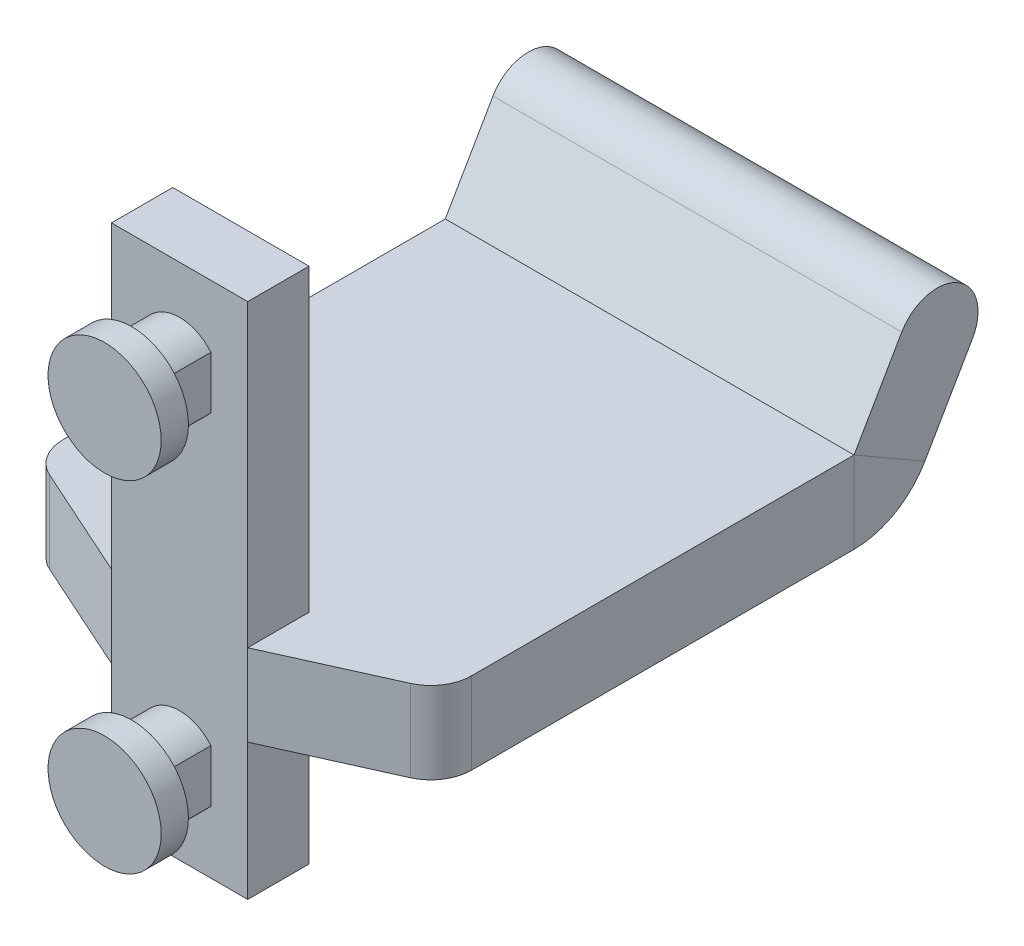
ISO-10303-21;
HEADER;
FILE_DESCRIPTION(('STEP AP214'),'2;1');
FILE_NAME('part.step','',(''),(''),'','','');
FILE_SCHEMA(('AUTOMOTIVE_DESIGN { 1 0 10303 214 1 1 1 1 }'));
ENDSEC;
DATA;
#1=APPLICATION_CONTEXT('core data for automotive mechanical design processes');
#2=APPLICATION_PROTOCOL_DEFINITION('international standard','automotive_design',2000,#1);
#3=PRODUCT_CONTEXT('',#1,'mechanical');
#4=PRODUCT('Part','Part','',(#3));
#5=PRODUCT_RELATED_PRODUCT_CATEGORY('part','',(#4));
#6=PRODUCT_DEFINITION_FORMATION('','',#4);
#7=PRODUCT_DEFINITION_CONTEXT('part definition',#1,'design');
#8=PRODUCT_DEFINITION('design','',#6,#7);
#9=PRODUCT_DEFINITION_SHAPE('','',#8);
#10=(LENGTH_UNIT() NAMED_UNIT(*) SI_UNIT(.MILLI.,.METRE.));
#11=(NAMED_UNIT(*) PLANE_ANGLE_UNIT() SI_UNIT($,.RADIAN.));
#12=(NAMED_UNIT(*) SI_UNIT($,.STERADIAN.) SOLID_ANGLE_UNIT());
#13=UNCERTAINTY_MEASURE_WITH_UNIT(LENGTH_MEASURE(1.E-05),#10,'distance_accuracy_value','');
#14=(GEOMETRIC_REPRESENTATION_CONTEXT(3) GLOBAL_UNCERTAINTY_ASSIGNED_CONTEXT((#13)) GLOBAL_UNIT_ASSIGNED_CONTEXT((#10,
#11,#12)) REPRESENTATION_CONTEXT('',''));
#15=CARTESIAN_POINT('',(0.,0.,0.));
#16=DIRECTION('',(0.,0.,1.));
#17=DIRECTION('',(1.,0.,0.));
#18=AXIS2_PLACEMENT_3D('',#15,#16,#17);
#19=CARTESIAN_POINT('',(-5.,6.5,-4.5));
#20=DIRECTION('',(1.,0.,0.));
#21=DIRECTION('',(0.,1.,0.));
#22=AXIS2_PLACEMENT_3D('',#19,#20,#21);
#23=PLANE('',#22);
#24=DIRECTION('',(0.,0.,-1.));
#25=VECTOR('',#24,1.);
#26=CARTESIAN_POINT('',(-5.,-21.5,-4.5));
#27=LINE('',#26,#25);
#28=CARTESIAN_POINT('',(-5.,-21.5,0.));
#29=VERTEX_POINT('',#28);
#30=CARTESIAN_POINT('',(-5.,-21.5,-4.5));
#31=VERTEX_POINT('',#30);
#32=EDGE_CURVE('E254',#29,#31,#27,.T.);
#33=ORIENTED_EDGE('',*,*,#32,.T.);
#34=DIRECTION('',(0.,1.,0.));
#35=VECTOR('',#34,1.);
#36=CARTESIAN_POINT('',(-5.,6.5,-4.5));
#37=LINE('',#36,#35);
#38=CARTESIAN_POINT('',(-5.,-31.5,-4.5));
#39=VERTEX_POINT('',#38);
#40=EDGE_CURVE('E373',#39,#31,#37,.T.);
#41=ORIENTED_EDGE('',*,*,#40,.F.);
#42=DIRECTION('',(0.,0.,1.));
#43=VECTOR('',#42,1.);
#44=CARTESIAN_POINT('',(-5.,-31.5,-4.5));
#45=LINE('',#44,#43);
#46=CARTESIAN_POINT('',(-5.,-31.5,0.));
#47=VERTEX_POINT('',#46);
#48=EDGE_CURVE('E403',#39,#47,#45,.T.);
#49=ORIENTED_EDGE('',*,*,#48,.T.);
#50=DIRECTION('',(0.,1.,0.));
#51=VECTOR('',#50,1.);
#52=CARTESIAN_POINT('',(-5.,6.5,0.));
#53=LINE('',#52,#51);
#54=EDGE_CURVE('E389',#47,#29,#53,.T.);
#55=ORIENTED_EDGE('',*,*,#54,.T.);
#56=EDGE_LOOP('',(#33,#41,#49,#55));
#57=FACE_BOUND('',#56,.T.);
#58=ADVANCED_FACE('F43',(#57),#23,.F.);
#59=CARTESIAN_POINT('',(5.,6.5,-4.5));
#60=DIRECTION('',(-1.,0.,0.));
#61=DIRECTION('',(0.,-1.,0.));
#62=AXIS2_PLACEMENT_3D('',#59,#60,#61);
#63=PLANE('',#62);
#64=DIRECTION('',(0.,0.,1.));
#65=VECTOR('',#64,1.);
#66=CARTESIAN_POINT('',(5.,-15.5,-4.5));
#67=LINE('',#66,#65);
#68=CARTESIAN_POINT('',(5.,-15.5,-4.5));
#69=VERTEX_POINT('',#68);
#70=CARTESIAN_POINT('',(5.,-15.5,0.));
#71=VERTEX_POINT('',#70);
#72=EDGE_CURVE('E268',#69,#71,#67,.T.);
#73=ORIENTED_EDGE('',*,*,#72,.F.);
#74=DIRECTION('',(0.,-1.,0.));
#75=VECTOR('',#74,1.);
#76=CARTESIAN_POINT('',(5.,6.5,-4.5));
#77=LINE('',#76,#75);
#78=CARTESIAN_POINT('',(5.,6.5,-4.5));
#79=VERTEX_POINT('',#78);
#80=EDGE_CURVE('E364',#79,#69,#77,.T.);
#81=ORIENTED_EDGE('',*,*,#80,.F.);
#82=DIRECTION('',(0.,0.,1.));
#83=VECTOR('',#82,1.);
#84=CARTESIAN_POINT('',(5.,6.5,-4.5));
#85=LINE('',#84,#83);
#86=CARTESIAN_POINT('',(5.,6.5,0.));
#87=VERTEX_POINT('',#86);
#88=EDGE_CURVE('E380',#79,#87,#85,.T.);
#89=ORIENTED_EDGE('',*,*,#88,.T.);
#90=DIRECTION('',(0.,-1.,0.));
#91=VECTOR('',#90,1.);
#92=CARTESIAN_POINT('',(5.,6.5,0.));
#93=LINE('',#92,#91);
#94=EDGE_CURVE('E381',#87,#71,#93,.T.);
#95=ORIENTED_EDGE('',*,*,#94,.T.);
#96=EDGE_LOOP('',(#73,#81,#89,#95));
#97=FACE_BOUND('',#96,.T.);
#98=ADVANCED_FACE('F593',(#97),#63,.F.);
#99=CARTESIAN_POINT('',(0.,0.,-4.5));
#100=DIRECTION('',(0.,0.,-1.));
#101=DIRECTION('',(-1.,0.,0.));
#102=AXIS2_PLACEMENT_3D('',#99,#100,#101);
#103=PLANE('',#102);
#104=DIRECTION('',(1.,0.,0.));
#105=VECTOR('',#104,1.);
#106=CARTESIAN_POINT('',(15.,-15.5,-4.5));
#107=LINE('',#106,#105);
#108=CARTESIAN_POINT('',(-5.,-15.5,-4.5));
#109=VERTEX_POINT('',#108);
#110=EDGE_CURVE('E287',#109,#69,#107,.T.);
#111=ORIENTED_EDGE('',*,*,#110,.F.);
#112=CARTESIAN_POINT('',(-5.,6.5,-4.5));
#113=VERTEX_POINT('',#112);
#114=EDGE_CURVE('E372',#109,#113,#37,.T.);
#115=ORIENTED_EDGE('',*,*,#114,.T.);
#116=DIRECTION('',(1.,0.,0.));
#117=VECTOR('',#116,1.);
#118=CARTESIAN_POINT('',(5.,6.5,-4.5));
#119=LINE('',#118,#117);
#120=EDGE_CURVE('E377',#113,#79,#119,.T.);
#121=ORIENTED_EDGE('',*,*,#120,.T.);
#122=ORIENTED_EDGE('',*,*,#80,.T.);
#123=EDGE_LOOP('',(#111,#115,#121,#122));
#124=FACE_BOUND('',#123,.T.);
#125=ADVANCED_FACE('F586',(#124),#103,.T.);
#126=CARTESIAN_POINT('',(0.,0.,0.));
#127=DIRECTION('',(0.,0.,-1.));
#128=DIRECTION('',(-1.,0.,0.));
#129=AXIS2_PLACEMENT_3D('',#126,#127,#128);
#130=PLANE('',#129);
#131=ORIENTED_EDGE('',*,*,#94,.F.);
#132=DIRECTION('',(1.,0.,0.));
#133=VECTOR('',#132,1.);
#134=CARTESIAN_POINT('',(5.,6.5,0.));
#135=LINE('',#134,#133);
#136=CARTESIAN_POINT('',(-5.,6.5,0.));
#137=VERTEX_POINT('',#136);
#138=EDGE_CURVE('E393',#137,#87,#135,.T.);
#139=ORIENTED_EDGE('',*,*,#138,.F.);
#140=CARTESIAN_POINT('',(-5.,-15.5,0.));
#141=VERTEX_POINT('',#140);
#142=EDGE_CURVE('E388',#141,#137,#53,.T.);
#143=ORIENTED_EDGE('',*,*,#142,.F.);
#144=DIRECTION('',(0.,1.,0.));
#145=VECTOR('',#144,1.);
#146=CARTESIAN_POINT('',(-5.,-21.5,0.));
#147=LINE('',#146,#145);
#148=EDGE_CURVE('E256',#29,#141,#147,.T.);
#149=ORIENTED_EDGE('',*,*,#148,.F.);
#150=ORIENTED_EDGE('',*,*,#54,.F.);
#151=DIRECTION('',(-1.,0.,0.));
#152=VECTOR('',#151,1.);
#153=CARTESIAN_POINT('',(5.,-31.5,0.));
#154=LINE('',#153,#152);
#155=CARTESIAN_POINT('',(5.,-31.5,0.));
#156=VERTEX_POINT('',#155);
#157=EDGE_CURVE('E385',#156,#47,#154,.T.);
#158=ORIENTED_EDGE('',*,*,#157,.F.);
#159=CARTESIAN_POINT('',(5.,-21.5,0.));
#160=VERTEX_POINT('',#159);
#161=EDGE_CURVE('E363',#160,#156,#93,.T.);
#162=ORIENTED_EDGE('',*,*,#161,.F.);
#163=DIRECTION('',(0.,1.,0.));
#164=VECTOR('',#163,1.);
#165=CARTESIAN_POINT('',(5.,-21.5,0.));
#166=LINE('',#165,#164);
#167=EDGE_CURVE('E272',#160,#71,#166,.T.);
#168=ORIENTED_EDGE('',*,*,#167,.T.);
#169=EDGE_LOOP('',(#131,#139,#143,#149,#150,#158,#162,#168));
#170=FACE_BOUND('',#169,.T.);
#171=CARTESIAN_POINT('',(0.,0.,0.));
#172=DIRECTION('',(0.,0.,1.));
#173=DIRECTION('',(1.,0.,0.));
#174=AXIS2_PLACEMENT_3D('',#171,#172,#173);
#175=CIRCLE('',#174,3.);
#176=CARTESIAN_POINT('',(2.3,1.92613602842582,0.));
#177=VERTEX_POINT('',#176);
#178=CARTESIAN_POINT('',(-2.3,1.92613602842582,0.));
#179=VERTEX_POINT('',#178);
#180=EDGE_CURVE('E416',#177,#179,#175,.T.);
#181=ORIENTED_EDGE('',*,*,#180,.F.);
#182=DIRECTION('',(0.,1.,0.));
#183=VECTOR('',#182,1.);
#184=CARTESIAN_POINT('',(2.3,1.92613602842582,0.));
#185=LINE('',#184,#183);
#186=CARTESIAN_POINT('',(2.3,-1.92613602842582,0.));
#187=VERTEX_POINT('',#186);
#188=EDGE_CURVE('E425',#187,#177,#185,.T.);
#189=ORIENTED_EDGE('',*,*,#188,.F.);
#190=CARTESIAN_POINT('',(0.,0.,0.));
#191=DIRECTION('',(0.,0.,1.));
#192=DIRECTION('',(1.,0.,0.));
#193=AXIS2_PLACEMENT_3D('',#190,#191,#192);
#194=CIRCLE('',#193,3.);
#195=CARTESIAN_POINT('',(-2.3,-1.92613602842582,0.));
#196=VERTEX_POINT('',#195);
#197=EDGE_CURVE('E445',#196,#187,#194,.T.);
#198=ORIENTED_EDGE('',*,*,#197,.F.);
#199=DIRECTION('',(0.,-1.,0.));
#200=VECTOR('',#199,1.);
#201=CARTESIAN_POINT('',(-2.3,1.92613602842582,0.));
#202=LINE('',#201,#200);
#203=EDGE_CURVE('E441',#179,#196,#202,.T.);
#204=ORIENTED_EDGE('',*,*,#203,.F.);
#205=EDGE_LOOP('',(#181,#189,#198,#204));
#206=FACE_BOUND('',#205,.T.);
#207=CARTESIAN_POINT('',(0.,-25.,0.));
#208=DIRECTION('',(0.,0.,1.));
#209=DIRECTION('',(1.,0.,0.));
#210=AXIS2_PLACEMENT_3D('',#207,#208,#209);
#211=CIRCLE('',#210,3.);
#212=CARTESIAN_POINT('',(2.3,-23.0738639715742,0.));
#213=VERTEX_POINT('',#212);
#214=CARTESIAN_POINT('',(-2.3,-23.0738639715742,0.));
#215=VERTEX_POINT('',#214);
#216=EDGE_CURVE('E312',#213,#215,#211,.T.);
#217=ORIENTED_EDGE('',*,*,#216,.F.);
#218=DIRECTION('',(0.,1.,0.));
#219=VECTOR('',#218,1.);
#220=CARTESIAN_POINT('',(2.3,-23.0738639715742,0.));
#221=LINE('',#220,#219);
#222=CARTESIAN_POINT('',(2.3,-26.9261360284258,0.));
#223=VERTEX_POINT('',#222);
#224=EDGE_CURVE('E321',#223,#213,#221,.T.);
#225=ORIENTED_EDGE('',*,*,#224,.F.);
#226=CARTESIAN_POINT('',(0.,-25.,0.));
#227=DIRECTION('',(0.,0.,1.));
#228=DIRECTION('',(1.,0.,0.));
#229=AXIS2_PLACEMENT_3D('',#226,#227,#228);
#230=CIRCLE('',#229,3.);
#231=CARTESIAN_POINT('',(-2.3,-26.9261360284258,0.));
#232=VERTEX_POINT('',#231);
#233=EDGE_CURVE('E341',#232,#223,#230,.T.);
#234=ORIENTED_EDGE('',*,*,#233,.F.);
#235=DIRECTION('',(0.,-1.,0.));
#236=VECTOR('',#235,1.);
#237=CARTESIAN_POINT('',(-2.3,-23.0738639715742,0.));
#238=LINE('',#237,#236);
#239=EDGE_CURVE('E337',#215,#232,#238,.T.);
#240=ORIENTED_EDGE('',*,*,#239,.F.);
#241=EDGE_LOOP('',(#217,#225,#234,#240));
#242=FACE_BOUND('',#241,.T.);
#243=ADVANCED_FACE('F565',(#170,#206,#242),#130,.F.);
#244=CARTESIAN_POINT('',(0.,0.,3.5));
#245=DIRECTION('',(0.,0.,-1.));
#246=DIRECTION('',(-1.,0.,0.));
#247=AXIS2_PLACEMENT_3D('',#244,#245,#246);
#248=CYLINDRICAL_SURFACE('',#247,3.);
#249=ORIENTED_EDGE('',*,*,#180,.T.);
#250=DIRECTION('',(0.,0.,-1.));
#251=VECTOR('',#250,1.);
#252=CARTESIAN_POINT('',(-2.3,1.92613602842582,3.5));
#253=LINE('',#252,#251);
#254=CARTESIAN_POINT('',(-2.3,1.92613602842582,3.5));
#255=VERTEX_POINT('',#254);
#256=EDGE_CURVE('E288',#255,#179,#253,.T.);
#257=ORIENTED_EDGE('',*,*,#256,.F.);
#258=CARTESIAN_POINT('',(0.,0.,3.5));
#259=DIRECTION('',(0.,0.,1.));
#260=DIRECTION('',(1.,0.,0.));
#261=AXIS2_PLACEMENT_3D('',#258,#259,#260);
#262=CIRCLE('',#261,3.);
#263=CARTESIAN_POINT('',(2.3,1.92613602842582,3.5));
#264=VERTEX_POINT('',#263);
#265=EDGE_CURVE('E420',#264,#255,#262,.T.);
#266=ORIENTED_EDGE('',*,*,#265,.F.);
#267=DIRECTION('',(0.,0.,-1.));
#268=VECTOR('',#267,1.);
#269=CARTESIAN_POINT('',(2.3,1.92613602842582,3.5));
#270=LINE('',#269,#268);
#271=EDGE_CURVE('E437',#264,#177,#270,.T.);
#272=ORIENTED_EDGE('',*,*,#271,.T.);
#273=EDGE_LOOP('',(#249,#257,#266,#272));
#274=FACE_BOUND('',#273,.T.);
#275=ADVANCED_FACE('F637',(#274),#248,.T.);
#276=CARTESIAN_POINT('',(-2.3,1.92613602842582,3.5));
#277=DIRECTION('',(1.,0.,0.));
#278=DIRECTION('',(0.,0.,-1.));
#279=AXIS2_PLACEMENT_3D('',#276,#277,#278);
#280=PLANE('',#279);
#281=ORIENTED_EDGE('',*,*,#203,.T.);
#282=DIRECTION('',(0.,0.,-1.));
#283=VECTOR('',#282,1.);
#284=CARTESIAN_POINT('',(-2.3,-1.92613602842582,3.5));
#285=LINE('',#284,#283);
#286=CARTESIAN_POINT('',(-2.3,-1.92613602842582,3.5));
#287=VERTEX_POINT('',#286);
#288=EDGE_CURVE('E459',#287,#196,#285,.T.);
#289=ORIENTED_EDGE('',*,*,#288,.F.);
#290=DIRECTION('',(0.,-1.,0.));
#291=VECTOR('',#290,1.);
#292=CARTESIAN_POINT('',(-2.3,1.92613602842582,3.5));
#293=LINE('',#292,#291);
#294=EDGE_CURVE('E424',#255,#287,#293,.T.);
#295=ORIENTED_EDGE('',*,*,#294,.F.);
#296=ORIENTED_EDGE('',*,*,#256,.T.);
#297=EDGE_LOOP('',(#281,#289,#295,#296));
#298=FACE_BOUND('',#297,.T.);
#299=ADVANCED_FACE('F633',(#298),#280,.F.);
#300=CARTESIAN_POINT('',(0.,0.,3.5));
#301=DIRECTION('',(0.,0.,-1.));
#302=DIRECTION('',(-1.,0.,0.));
#303=AXIS2_PLACEMENT_3D('',#300,#301,#302);
#304=CYLINDRICAL_SURFACE('',#303,3.);
#305=ORIENTED_EDGE('',*,*,#197,.T.);
#306=DIRECTION('',(0.,0.,-1.));
#307=VECTOR('',#306,1.);
#308=CARTESIAN_POINT('',(2.3,-1.92613602842582,3.5));
#309=LINE('',#308,#307);
#310=CARTESIAN_POINT('',(2.3,-1.92613602842582,3.5));
#311=VERTEX_POINT('',#310);
#312=EDGE_CURVE('E455',#311,#187,#309,.T.);
#313=ORIENTED_EDGE('',*,*,#312,.F.);
#314=CARTESIAN_POINT('',(0.,0.,3.5));
#315=DIRECTION('',(0.,0.,1.));
#316=DIRECTION('',(1.,0.,0.));
#317=AXIS2_PLACEMENT_3D('',#314,#315,#316);
#318=CIRCLE('',#317,3.);
#319=EDGE_CURVE('E429',#287,#311,#318,.T.);
#320=ORIENTED_EDGE('',*,*,#319,.F.);
#321=ORIENTED_EDGE('',*,*,#288,.T.);
#322=EDGE_LOOP('',(#305,#313,#320,#321));
#323=FACE_BOUND('',#322,.T.);
#324=ADVANCED_FACE('F629',(#323),#304,.T.);
#325=CARTESIAN_POINT('',(2.3,1.92613602842582,3.5));
#326=DIRECTION('',(-1.,0.,0.));
#327=DIRECTION('',(0.,0.,1.));
#328=AXIS2_PLACEMENT_3D('',#325,#326,#327);
#329=PLANE('',#328);
#330=ORIENTED_EDGE('',*,*,#188,.T.);
#331=ORIENTED_EDGE('',*,*,#271,.F.);
#332=DIRECTION('',(0.,1.,0.));
#333=VECTOR('',#332,1.);
#334=CARTESIAN_POINT('',(2.3,1.92613602842582,3.5));
#335=LINE('',#334,#333);
#336=EDGE_CURVE('E433',#311,#264,#335,.T.);
#337=ORIENTED_EDGE('',*,*,#336,.F.);
#338=ORIENTED_EDGE('',*,*,#312,.T.);
#339=EDGE_LOOP('',(#330,#331,#337,#338));
#340=FACE_BOUND('',#339,.T.);
#341=ADVANCED_FACE('F622',(#340),#329,.F.);
#342=CARTESIAN_POINT('',(0.,0.,3.5));
#343=DIRECTION('',(0.,0.,1.));
#344=DIRECTION('',(1.,0.,0.));
#345=AXIS2_PLACEMENT_3D('',#342,#343,#344);
#346=PLANE('',#345);
#347=CARTESIAN_POINT('',(0.,0.,3.5));
#348=DIRECTION('',(0.,0.,1.));
#349=DIRECTION('',(1.,0.,0.));
#350=AXIS2_PLACEMENT_3D('',#347,#348,#349);
#351=CIRCLE('',#350,4.15);
#352=CARTESIAN_POINT('',(4.15,0.,3.5));
#353=VERTEX_POINT('',#352);
#354=EDGE_CURVE('E411',#353,#353,#351,.T.);
#355=ORIENTED_EDGE('',*,*,#354,.F.);
#356=EDGE_LOOP('',(#355));
#357=FACE_BOUND('',#356,.T.);
#358=ORIENTED_EDGE('',*,*,#336,.T.);
#359=ORIENTED_EDGE('',*,*,#265,.T.);
#360=ORIENTED_EDGE('',*,*,#294,.T.);
#361=ORIENTED_EDGE('',*,*,#319,.T.);
#362=EDGE_LOOP('',(#358,#359,#360,#361));
#363=FACE_BOUND('',#362,.T.);
#364=ADVANCED_FACE('F619',(#357,#363),#346,.F.);
#365=CARTESIAN_POINT('',(0.,0.,5.5));
#366=DIRECTION('',(0.,0.,-1.));
#367=DIRECTION('',(-1.,0.,0.));
#368=AXIS2_PLACEMENT_3D('',#365,#366,#367);
#369=CYLINDRICAL_SURFACE('',#368,4.15);
#370=CARTESIAN_POINT('',(0.,0.,5.5));
#371=DIRECTION('',(0.,0.,1.));
#372=DIRECTION('',(1.,0.,0.));
#373=AXIS2_PLACEMENT_3D('',#370,#371,#372);
#374=CIRCLE('',#373,4.15);
#375=CARTESIAN_POINT('',(4.15,0.,5.5));
#376=VERTEX_POINT('',#375);
#377=EDGE_CURVE('E412',#376,#376,#374,.T.);
#378=ORIENTED_EDGE('',*,*,#377,.F.);
#379=EDGE_LOOP('',(#378));
#380=FACE_BOUND('',#379,.T.);
#381=ORIENTED_EDGE('',*,*,#354,.T.);
#382=EDGE_LOOP('',(#381));
#383=FACE_BOUND('',#382,.T.);
#384=ADVANCED_FACE('F617',(#380,#383),#369,.T.);
#385=CARTESIAN_POINT('',(0.,0.,5.5));
#386=DIRECTION('',(0.,0.,1.));
#387=DIRECTION('',(1.,0.,0.));
#388=AXIS2_PLACEMENT_3D('',#385,#386,#387);
#389=PLANE('',#388);
#390=ORIENTED_EDGE('',*,*,#377,.T.);
#391=EDGE_LOOP('',(#390));
#392=FACE_BOUND('',#391,.T.);
#393=ADVANCED_FACE('F613',(#392),#389,.T.);
#394=CARTESIAN_POINT('',(5.,-21.5,-4.5));
#395=VERTEX_POINT('',#394);
#396=CARTESIAN_POINT('',(5.,-31.5,-4.5));
#397=VERTEX_POINT('',#396);
#398=EDGE_CURVE('E369',#395,#397,#77,.T.);
#399=ORIENTED_EDGE('',*,*,#398,.F.);
#400=DIRECTION('',(0.,0.,1.));
#401=VECTOR('',#400,1.);
#402=CARTESIAN_POINT('',(5.,-21.5,-4.5));
#403=LINE('',#402,#401);
#404=EDGE_CURVE('E267',#395,#160,#403,.T.);
#405=ORIENTED_EDGE('',*,*,#404,.T.);
#406=ORIENTED_EDGE('',*,*,#161,.T.);
#407=DIRECTION('',(0.,0.,1.));
#408=VECTOR('',#407,1.);
#409=CARTESIAN_POINT('',(5.,-31.5,-4.5));
#410=LINE('',#409,#408);
#411=EDGE_CURVE('E407',#397,#156,#410,.T.);
#412=ORIENTED_EDGE('',*,*,#411,.F.);
#413=EDGE_LOOP('',(#399,#405,#406,#412));
#414=FACE_BOUND('',#413,.T.);
#415=ADVANCED_FACE('F574',(#414),#63,.F.);
#416=CARTESIAN_POINT('',(5.,-31.5,-4.5));
#417=DIRECTION('',(0.,1.,0.));
#418=DIRECTION('',(0.,0.,1.));
#419=AXIS2_PLACEMENT_3D('',#416,#417,#418);
#420=PLANE('',#419);
#421=ORIENTED_EDGE('',*,*,#157,.T.);
#422=ORIENTED_EDGE('',*,*,#48,.F.);
#423=DIRECTION('',(-1.,0.,0.));
#424=VECTOR('',#423,1.);
#425=CARTESIAN_POINT('',(5.,-31.5,-4.5));
#426=LINE('',#425,#424);
#427=EDGE_CURVE('E368',#397,#39,#426,.T.);
#428=ORIENTED_EDGE('',*,*,#427,.F.);
#429=ORIENTED_EDGE('',*,*,#411,.T.);
#430=EDGE_LOOP('',(#421,#422,#428,#429));
#431=FACE_BOUND('',#430,.T.);
#432=ADVANCED_FACE('F578',(#431),#420,.F.);
#433=ORIENTED_EDGE('',*,*,#114,.F.);
#434=DIRECTION('',(0.,0.,-1.));
#435=VECTOR('',#434,1.);
#436=CARTESIAN_POINT('',(-5.,-15.5,-4.5));
#437=LINE('',#436,#435);
#438=EDGE_CURVE('E245',#141,#109,#437,.T.);
#439=ORIENTED_EDGE('',*,*,#438,.F.);
#440=ORIENTED_EDGE('',*,*,#142,.T.);
#441=DIRECTION('',(0.,0.,1.));
#442=VECTOR('',#441,1.);
#443=CARTESIAN_POINT('',(-5.,6.5,-4.5));
#444=LINE('',#443,#442);
#445=EDGE_CURVE('E399',#113,#137,#444,.T.);
#446=ORIENTED_EDGE('',*,*,#445,.F.);
#447=EDGE_LOOP('',(#433,#439,#440,#446));
#448=FACE_BOUND('',#447,.T.);
#449=ADVANCED_FACE('F560',(#448),#23,.F.);
#450=CARTESIAN_POINT('',(5.,6.5,-4.5));
#451=DIRECTION('',(0.,-1.,0.));
#452=DIRECTION('',(1.,0.,0.));
#453=AXIS2_PLACEMENT_3D('',#450,#451,#452);
#454=PLANE('',#453);
#455=ORIENTED_EDGE('',*,*,#138,.T.);
#456=ORIENTED_EDGE('',*,*,#88,.F.);
#457=ORIENTED_EDGE('',*,*,#120,.F.);
#458=ORIENTED_EDGE('',*,*,#445,.T.);
#459=EDGE_LOOP('',(#455,#456,#457,#458));
#460=FACE_BOUND('',#459,.T.);
#461=ADVANCED_FACE('F590',(#460),#454,.F.);
#462=DIRECTION('',(-1.,0.,0.));
#463=VECTOR('',#462,1.);
#464=CARTESIAN_POINT('',(15.,-21.5,-4.5));
#465=LINE('',#464,#463);
#466=EDGE_CURVE('E283',#395,#31,#465,.T.);
#467=ORIENTED_EDGE('',*,*,#466,.F.);
#468=ORIENTED_EDGE('',*,*,#398,.T.);
#469=ORIENTED_EDGE('',*,*,#427,.T.);
#470=ORIENTED_EDGE('',*,*,#40,.T.);
#471=EDGE_LOOP('',(#467,#468,#469,#470));
#472=FACE_BOUND('',#471,.T.);
#473=ADVANCED_FACE('F582',(#472),#103,.T.);
#474=CARTESIAN_POINT('',(0.,-25.,3.5));
#475=DIRECTION('',(0.,0.,-1.));
#476=DIRECTION('',(-1.,0.,0.));
#477=AXIS2_PLACEMENT_3D('',#474,#475,#476);
#478=CYLINDRICAL_SURFACE('',#477,3.);
#479=ORIENTED_EDGE('',*,*,#216,.T.);
#480=DIRECTION('',(0.,0.,-1.));
#481=VECTOR('',#480,1.);
#482=CARTESIAN_POINT('',(-2.3,-23.0738639715742,3.5));
#483=LINE('',#482,#481);
#484=CARTESIAN_POINT('',(-2.3,-23.0738639715742,3.5));
#485=VERTEX_POINT('',#484);
#486=EDGE_CURVE('E359',#485,#215,#483,.T.);
#487=ORIENTED_EDGE('',*,*,#486,.F.);
#488=CARTESIAN_POINT('',(0.,-25.,3.5));
#489=DIRECTION('',(0.,0.,1.));
#490=DIRECTION('',(1.,0.,0.));
#491=AXIS2_PLACEMENT_3D('',#488,#489,#490);
#492=CIRCLE('',#491,3.);
#493=CARTESIAN_POINT('',(2.3,-23.0738639715742,3.5));
#494=VERTEX_POINT('',#493);
#495=EDGE_CURVE('E316',#494,#485,#492,.T.);
#496=ORIENTED_EDGE('',*,*,#495,.F.);
#497=DIRECTION('',(0.,0.,-1.));
#498=VECTOR('',#497,1.);
#499=CARTESIAN_POINT('',(2.3,-23.0738639715742,3.5));
#500=LINE('',#499,#498);
#501=EDGE_CURVE('E333',#494,#213,#500,.T.);
#502=ORIENTED_EDGE('',*,*,#501,.T.);
#503=EDGE_LOOP('',(#479,#487,#496,#502));
#504=FACE_BOUND('',#503,.T.);
#505=ADVANCED_FACE('F704',(#504),#478,.T.);
#506=CARTESIAN_POINT('',(-2.3,-23.0738639715742,3.5));
#507=DIRECTION('',(1.,0.,0.));
#508=DIRECTION('',(0.,0.,-1.));
#509=AXIS2_PLACEMENT_3D('',#506,#507,#508);
#510=PLANE('',#509);
#511=ORIENTED_EDGE('',*,*,#239,.T.);
#512=DIRECTION('',(0.,0.,-1.));
#513=VECTOR('',#512,1.);
#514=CARTESIAN_POINT('',(-2.3,-26.9261360284258,3.5));
#515=LINE('',#514,#513);
#516=CARTESIAN_POINT('',(-2.3,-26.9261360284258,3.5));
#517=VERTEX_POINT('',#516);
#518=EDGE_CURVE('E355',#517,#232,#515,.T.);
#519=ORIENTED_EDGE('',*,*,#518,.F.);
#520=DIRECTION('',(0.,-1.,0.));
#521=VECTOR('',#520,1.);
#522=CARTESIAN_POINT('',(-2.3,-23.0738639715742,3.5));
#523=LINE('',#522,#521);
#524=EDGE_CURVE('E320',#485,#517,#523,.T.);
#525=ORIENTED_EDGE('',*,*,#524,.F.);
#526=ORIENTED_EDGE('',*,*,#486,.T.);
#527=EDGE_LOOP('',(#511,#519,#525,#526));
#528=FACE_BOUND('',#527,.T.);
#529=ADVANCED_FACE('F700',(#528),#510,.F.);
#530=CARTESIAN_POINT('',(0.,-25.,3.5));
#531=DIRECTION('',(0.,0.,-1.));
#532=DIRECTION('',(-1.,0.,0.));
#533=AXIS2_PLACEMENT_3D('',#530,#531,#532);
#534=CYLINDRICAL_SURFACE('',#533,3.);
#535=ORIENTED_EDGE('',*,*,#233,.T.);
#536=DIRECTION('',(0.,0.,-1.));
#537=VECTOR('',#536,1.);
#538=CARTESIAN_POINT('',(2.3,-26.9261360284258,3.5));
#539=LINE('',#538,#537);
#540=CARTESIAN_POINT('',(2.3,-26.9261360284258,3.5));
#541=VERTEX_POINT('',#540);
#542=EDGE_CURVE('E351',#541,#223,#539,.T.);
#543=ORIENTED_EDGE('',*,*,#542,.F.);
#544=CARTESIAN_POINT('',(0.,-25.,3.5));
#545=DIRECTION('',(0.,0.,1.));
#546=DIRECTION('',(1.,0.,0.));
#547=AXIS2_PLACEMENT_3D('',#544,#545,#546);
#548=CIRCLE('',#547,3.);
#549=EDGE_CURVE('E325',#517,#541,#548,.T.);
#550=ORIENTED_EDGE('',*,*,#549,.F.);
#551=ORIENTED_EDGE('',*,*,#518,.T.);
#552=EDGE_LOOP('',(#535,#543,#550,#551));
#553=FACE_BOUND('',#552,.T.);
#554=ADVANCED_FACE('F696',(#553),#534,.T.);
#555=CARTESIAN_POINT('',(2.3,-23.0738639715742,3.5));
#556=DIRECTION('',(-1.,0.,0.));
#557=DIRECTION('',(0.,-1.,0.));
#558=AXIS2_PLACEMENT_3D('',#555,#556,#557);
#559=PLANE('',#558);
#560=ORIENTED_EDGE('',*,*,#224,.T.);
#561=ORIENTED_EDGE('',*,*,#501,.F.);
#562=DIRECTION('',(0.,1.,0.));
#563=VECTOR('',#562,1.);
#564=CARTESIAN_POINT('',(2.3,-23.0738639715742,3.5));
#565=LINE('',#564,#563);
#566=EDGE_CURVE('E329',#541,#494,#565,.T.);
#567=ORIENTED_EDGE('',*,*,#566,.F.);
#568=ORIENTED_EDGE('',*,*,#542,.T.);
#569=EDGE_LOOP('',(#560,#561,#567,#568));
#570=FACE_BOUND('',#569,.T.);
#571=ADVANCED_FACE('F689',(#570),#559,.F.);
#572=CARTESIAN_POINT('',(0.,-25.,3.5));
#573=DIRECTION('',(0.,0.,1.));
#574=DIRECTION('',(1.,0.,0.));
#575=AXIS2_PLACEMENT_3D('',#572,#573,#574);
#576=PLANE('',#575);
#577=CARTESIAN_POINT('',(0.,-25.,3.5));
#578=DIRECTION('',(0.,0.,1.));
#579=DIRECTION('',(1.,0.,0.));
#580=AXIS2_PLACEMENT_3D('',#577,#578,#579);
#581=CIRCLE('',#580,4.15);
#582=CARTESIAN_POINT('',(4.15,-25.,3.5));
#583=VERTEX_POINT('',#582);
#584=EDGE_CURVE('E307',#583,#583,#581,.T.);
#585=ORIENTED_EDGE('',*,*,#584,.F.);
#586=EDGE_LOOP('',(#585));
#587=FACE_BOUND('',#586,.T.);
#588=ORIENTED_EDGE('',*,*,#566,.T.);
#589=ORIENTED_EDGE('',*,*,#495,.T.);
#590=ORIENTED_EDGE('',*,*,#524,.T.);
#591=ORIENTED_EDGE('',*,*,#549,.T.);
#592=EDGE_LOOP('',(#588,#589,#590,#591));
#593=FACE_BOUND('',#592,.T.);
#594=ADVANCED_FACE('F686',(#587,#593),#576,.F.);
#595=CARTESIAN_POINT('',(0.,-25.,5.5));
#596=DIRECTION('',(0.,0.,-1.));
#597=DIRECTION('',(-1.,0.,0.));
#598=AXIS2_PLACEMENT_3D('',#595,#596,#597);
#599=CYLINDRICAL_SURFACE('',#598,4.15);
#600=CARTESIAN_POINT('',(0.,-25.,5.5));
#601=DIRECTION('',(0.,0.,1.));
#602=DIRECTION('',(1.,0.,0.));
#603=AXIS2_PLACEMENT_3D('',#600,#601,#602);
#604=CIRCLE('',#603,4.15);
#605=CARTESIAN_POINT('',(4.15,-25.,5.5));
#606=VERTEX_POINT('',#605);
#607=EDGE_CURVE('E308',#606,#606,#604,.T.);
#608=ORIENTED_EDGE('',*,*,#607,.F.);
#609=EDGE_LOOP('',(#608));
#610=FACE_BOUND('',#609,.T.);
#611=ORIENTED_EDGE('',*,*,#584,.T.);
#612=EDGE_LOOP('',(#611));
#613=FACE_BOUND('',#612,.T.);
#614=ADVANCED_FACE('F684',(#610,#613),#599,.T.);
#615=CARTESIAN_POINT('',(0.,-25.,5.5));
#616=DIRECTION('',(0.,0.,1.));
#617=DIRECTION('',(1.,0.,0.));
#618=AXIS2_PLACEMENT_3D('',#615,#616,#617);
#619=PLANE('',#618);
#620=ORIENTED_EDGE('',*,*,#607,.T.);
#621=EDGE_LOOP('',(#620));
#622=FACE_BOUND('',#621,.T.);
#623=ADVANCED_FACE('F681',(#622),#619,.T.);
#624=CARTESIAN_POINT('',(15.,-15.5,-29.5));
#625=DIRECTION('',(-1.,0.,0.));
#626=DIRECTION('',(0.,0.,1.));
#627=AXIS2_PLACEMENT_3D('',#624,#625,#626);
#628=PLANE('',#627);
#629=DIRECTION('',(0.,0.,1.));
#630=VECTOR('',#629,1.);
#631=CARTESIAN_POINT('',(15.,-15.5,-29.5));
#632=LINE('',#631,#630);
#633=CARTESIAN_POINT('',(15.,-15.5,-34.5));
#634=VERTEX_POINT('',#633);
#635=CARTESIAN_POINT('',(15.,-15.5,-6.4397568299192));
#636=VERTEX_POINT('',#635);
#637=EDGE_CURVE('E282',#634,#636,#632,.T.);
#638=ORIENTED_EDGE('',*,*,#637,.T.);
#639=DIRECTION('',(0.,-1.,0.));
#640=VECTOR('',#639,1.);
#641=CARTESIAN_POINT('',(15.,-21.5,-6.4397568299192));
#642=LINE('',#641,#640);
#643=CARTESIAN_POINT('',(15.,-21.5,-6.4397568299192));
#644=VERTEX_POINT('',#643);
#645=EDGE_CURVE('E52',#636,#644,#642,.T.);
#646=ORIENTED_EDGE('',*,*,#645,.T.);
#647=DIRECTION('',(0.,0.,1.));
#648=VECTOR('',#647,1.);
#649=CARTESIAN_POINT('',(15.,-21.5,-29.5));
#650=LINE('',#649,#648);
#651=CARTESIAN_POINT('',(15.,-21.5,-34.5));
#652=VERTEX_POINT('',#651);
#653=EDGE_CURVE('E304',#652,#644,#650,.T.);
#654=ORIENTED_EDGE('',*,*,#653,.F.);
#655=DIRECTION('',(0.,-1.,0.));
#656=VECTOR('',#655,1.);
#657=CARTESIAN_POINT('',(15.,-15.5,-34.5));
#658=LINE('',#657,#656);
#659=EDGE_CURVE('E233',#634,#652,#658,.T.);
#660=ORIENTED_EDGE('',*,*,#659,.F.);
#661=EDGE_LOOP('',(#638,#646,#654,#660));
#662=FACE_BOUND('',#661,.T.);
#663=ADVANCED_FACE('F484',(#662),#628,.F.);
#664=CARTESIAN_POINT('',(15.,-21.5,-29.5));
#665=DIRECTION('',(0.,1.,0.));
#666=DIRECTION('',(0.,0.,1.));
#667=AXIS2_PLACEMENT_3D('',#664,#665,#666);
#668=PLANE('',#667);
#669=DIRECTION('',(0.911921505175107,0.,0.410364677328798));
#670=VECTOR('',#669,1.);
#671=CARTESIAN_POINT('',(-5.,-21.5,0.));
#672=LINE('',#671,#670);
#673=CARTESIAN_POINT('',(-13.2310940319864,-21.5,-3.70399231439388));
#674=VERTEX_POINT('',#673);
#675=EDGE_CURVE('E251',#674,#29,#672,.T.);
#676=ORIENTED_EDGE('',*,*,#675,.F.);
#677=CARTESIAN_POINT('',(-12.,-21.5,-6.4397568299192));
#678=DIRECTION('',(0.,1.,0.));
#679=DIRECTION('',(0.,0.,1.));
#680=AXIS2_PLACEMENT_3D('',#677,#678,#679);
#681=CIRCLE('',#680,3.);
#682=CARTESIAN_POINT('',(-15.,-21.5,-6.4397568299192));
#683=VERTEX_POINT('',#682);
#684=EDGE_CURVE('E480',#674,#683,#681,.F.);
#685=ORIENTED_EDGE('',*,*,#684,.T.);
#686=DIRECTION('',(0.,0.,1.));
#687=VECTOR('',#686,1.);
#688=CARTESIAN_POINT('',(-15.,-21.5,-29.5));
#689=LINE('',#688,#687);
#690=CARTESIAN_POINT('',(-15.,-21.5,-34.5));
#691=VERTEX_POINT('',#690);
#692=EDGE_CURVE('E300',#691,#683,#689,.T.);
#693=ORIENTED_EDGE('',*,*,#692,.F.);
#694=DIRECTION('',(-1.,0.,0.));
#695=VECTOR('',#694,1.);
#696=CARTESIAN_POINT('',(15.,-21.5,-34.5));
#697=LINE('',#696,#695);
#698=EDGE_CURVE('E492',#652,#691,#697,.T.);
#699=ORIENTED_EDGE('',*,*,#698,.F.);
#700=ORIENTED_EDGE('',*,*,#653,.T.);
#701=CARTESIAN_POINT('',(12.,-21.5,-6.4397568299192));
#702=DIRECTION('',(0.,1.,0.));
#703=DIRECTION('',(0.,0.,1.));
#704=AXIS2_PLACEMENT_3D('',#701,#702,#703);
#705=CIRCLE('',#704,3.);
#706=CARTESIAN_POINT('',(13.2310940319864,-21.5,-3.70399231439388));
#707=VERTEX_POINT('',#706);
#708=EDGE_CURVE('E59',#644,#707,#705,.F.);
#709=ORIENTED_EDGE('',*,*,#708,.T.);
#710=DIRECTION('',(0.911921505175106,0.,-0.410364677328798));
#711=VECTOR('',#710,1.);
#712=CARTESIAN_POINT('',(5.,-21.5,0.));
#713=LINE('',#712,#711);
#714=EDGE_CURVE('E264',#160,#707,#713,.T.);
#715=ORIENTED_EDGE('',*,*,#714,.F.);
#716=ORIENTED_EDGE('',*,*,#404,.F.);
#717=ORIENTED_EDGE('',*,*,#466,.T.);
#718=ORIENTED_EDGE('',*,*,#32,.F.);
#719=EDGE_LOOP('',(#676,#685,#693,#699,#700,#709,#715,#716,#717,#718));
#720=FACE_BOUND('',#719,.T.);
#721=ADVANCED_FACE('F490',(#720),#668,.F.);
#722=CARTESIAN_POINT('',(-15.,-15.5,-29.5));
#723=DIRECTION('',(1.,0.,0.));
#724=DIRECTION('',(0.,1.,0.));
#725=AXIS2_PLACEMENT_3D('',#722,#723,#724);
#726=PLANE('',#725);
#727=ORIENTED_EDGE('',*,*,#692,.T.);
#728=DIRECTION('',(0.,1.,0.));
#729=VECTOR('',#728,1.);
#730=CARTESIAN_POINT('',(-15.,-15.5,-6.4397568299192));
#731=LINE('',#730,#729);
#732=CARTESIAN_POINT('',(-15.,-15.5,-6.4397568299192));
#733=VERTEX_POINT('',#732);
#734=EDGE_CURVE('E292',#683,#733,#731,.T.);
#735=ORIENTED_EDGE('',*,*,#734,.T.);
#736=DIRECTION('',(0.,0.,1.));
#737=VECTOR('',#736,1.);
#738=CARTESIAN_POINT('',(-15.,-15.5,-29.5));
#739=LINE('',#738,#737);
#740=CARTESIAN_POINT('',(-15.,-15.5,-34.5));
#741=VERTEX_POINT('',#740);
#742=EDGE_CURVE('E296',#741,#733,#739,.T.);
#743=ORIENTED_EDGE('',*,*,#742,.F.);
#744=DIRECTION('',(0.,1.,0.));
#745=VECTOR('',#744,1.);
#746=CARTESIAN_POINT('',(-15.,-15.5,-34.5));
#747=LINE('',#746,#745);
#748=EDGE_CURVE('E498',#691,#741,#747,.T.);
#749=ORIENTED_EDGE('',*,*,#748,.F.);
#750=EDGE_LOOP('',(#727,#735,#743,#749));
#751=FACE_BOUND('',#750,.T.);
#752=ADVANCED_FACE('F543',(#751),#726,.F.);
#753=CARTESIAN_POINT('',(15.,-15.5,-29.5));
#754=DIRECTION('',(0.,-1.,0.));
#755=DIRECTION('',(0.,0.,-1.));
#756=AXIS2_PLACEMENT_3D('',#753,#754,#755);
#757=PLANE('',#756);
#758=ORIENTED_EDGE('',*,*,#742,.T.);
#759=CARTESIAN_POINT('',(-12.,-15.5,-6.4397568299192));
#760=DIRECTION('',(0.,-1.,0.));
#761=DIRECTION('',(0.,0.,-1.));
#762=AXIS2_PLACEMENT_3D('',#759,#760,#761);
#763=CIRCLE('',#762,3.);
#764=CARTESIAN_POINT('',(-13.2310940319864,-15.5,-3.70399231439388));
#765=VERTEX_POINT('',#764);
#766=EDGE_CURVE('E472',#733,#765,#763,.F.);
#767=ORIENTED_EDGE('',*,*,#766,.T.);
#768=DIRECTION('',(0.911921505175107,0.,0.410364677328798));
#769=VECTOR('',#768,1.);
#770=CARTESIAN_POINT('',(-5.,-15.5,0.));
#771=LINE('',#770,#769);
#772=EDGE_CURVE('E240',#765,#141,#771,.T.);
#773=ORIENTED_EDGE('',*,*,#772,.T.);
#774=ORIENTED_EDGE('',*,*,#438,.T.);
#775=ORIENTED_EDGE('',*,*,#110,.T.);
#776=ORIENTED_EDGE('',*,*,#72,.T.);
#777=DIRECTION('',(0.911921505175106,0.,-0.410364677328798));
#778=VECTOR('',#777,1.);
#779=CARTESIAN_POINT('',(5.,-15.5,0.));
#780=LINE('',#779,#778);
#781=CARTESIAN_POINT('',(13.2310940319864,-15.5,-3.70399231439388));
#782=VERTEX_POINT('',#781);
#783=EDGE_CURVE('E263',#71,#782,#780,.T.);
#784=ORIENTED_EDGE('',*,*,#783,.T.);
#785=CARTESIAN_POINT('',(12.,-15.5,-6.4397568299192));
#786=DIRECTION('',(0.,-1.,0.));
#787=DIRECTION('',(0.,0.,-1.));
#788=AXIS2_PLACEMENT_3D('',#785,#786,#787);
#789=CIRCLE('',#788,3.);
#790=EDGE_CURVE('E469',#782,#636,#789,.F.);
#791=ORIENTED_EDGE('',*,*,#790,.T.);
#792=ORIENTED_EDGE('',*,*,#637,.F.);
#793=DIRECTION('',(1.,0.,0.));
#794=VECTOR('',#793,1.);
#795=CARTESIAN_POINT('',(15.,-15.5,-34.5));
#796=LINE('',#795,#794);
#797=EDGE_CURVE('E219',#741,#634,#796,.T.);
#798=ORIENTED_EDGE('',*,*,#797,.F.);
#799=EDGE_LOOP('',(#758,#767,#773,#774,#775,#776,#784,#791,#792,#798));
#800=FACE_BOUND('',#799,.T.);
#801=ADVANCED_FACE('F539',(#800),#757,.F.);
#802=CARTESIAN_POINT('',(5.,-21.5,0.));
#803=DIRECTION('',(0.410364677328798,0.,0.911921505175106));
#804=DIRECTION('',(0.911921505175107,0.,-0.410364677328798));
#805=AXIS2_PLACEMENT_3D('',#802,#803,#804);
#806=PLANE('',#805);
#807=ORIENTED_EDGE('',*,*,#714,.T.);
#808=DIRECTION('',(0.,-1.,0.));
#809=VECTOR('',#808,1.);
#810=CARTESIAN_POINT('',(13.2310940319864,-15.5,-3.70399231439388));
#811=LINE('',#810,#809);
#812=EDGE_CURVE('E11',#707,#782,#811,.F.);
#813=ORIENTED_EDGE('',*,*,#812,.T.);
#814=ORIENTED_EDGE('',*,*,#783,.F.);
#815=ORIENTED_EDGE('',*,*,#167,.F.);
#816=EDGE_LOOP('',(#807,#813,#814,#815));
#817=FACE_BOUND('',#816,.T.);
#818=ADVANCED_FACE('F595',(#817),#806,.T.);
#819=CARTESIAN_POINT('',(-5.,-21.5,0.));
#820=DIRECTION('',(-0.410364677328798,0.,0.911921505175107));
#821=DIRECTION('',(0.911921505175107,0.,0.410364677328798));
#822=AXIS2_PLACEMENT_3D('',#819,#820,#821);
#823=PLANE('',#822);
#824=ORIENTED_EDGE('',*,*,#772,.F.);
#825=DIRECTION('',(0.,1.,0.));
#826=VECTOR('',#825,1.);
#827=CARTESIAN_POINT('',(-13.2310940319864,-21.5,-3.70399231439388));
#828=LINE('',#827,#826);
#829=EDGE_CURVE('E475',#765,#674,#828,.F.);
#830=ORIENTED_EDGE('',*,*,#829,.T.);
#831=ORIENTED_EDGE('',*,*,#675,.T.);
#832=ORIENTED_EDGE('',*,*,#148,.T.);
#833=EDGE_LOOP('',(#824,#830,#831,#832));
#834=FACE_BOUND('',#833,.T.);
#835=ADVANCED_FACE('F551',(#834),#823,.T.);
#836=CARTESIAN_POINT('',(15.,-15.5,-34.5));
#837=DIRECTION('',(1.,0.,0.));
#838=DIRECTION('',(0.,0.,-1.));
#839=AXIS2_PLACEMENT_3D('',#836,#837,#838);
#840=PLANE('',#839);
#841=CARTESIAN_POINT('',(15.,-15.5,-34.5));
#842=DIRECTION('',(1.,0.,0.));
#843=DIRECTION('',(0.,-1.,0.));
#844=AXIS2_PLACEMENT_3D('',#841,#842,#843);
#845=CIRCLE('',#844,6.);
#846=CARTESIAN_POINT('',(15.,-18.5,-39.6961524227066));
#847=VERTEX_POINT('',#846);
#848=EDGE_CURVE('E503',#652,#847,#845,.T.);
#849=ORIENTED_EDGE('',*,*,#848,.T.);
#850=DIRECTION('',(0.,-0.499999999999998,-0.86602540378444));
#851=VECTOR('',#850,1.);
#852=CARTESIAN_POINT('',(15.,-15.5,-34.5));
#853=LINE('',#852,#851);
#854=EDGE_CURVE('E504',#634,#847,#853,.T.);
#855=ORIENTED_EDGE('',*,*,#854,.F.);
#856=ORIENTED_EDGE('',*,*,#659,.T.);
#857=EDGE_LOOP('',(#849,#855,#856));
#858=FACE_BOUND('',#857,.T.);
#859=ADVANCED_FACE('F502',(#858),#840,.T.);
#860=CARTESIAN_POINT('',(0.,-15.5,-34.5));
#861=DIRECTION('',(1.,0.,0.));
#862=DIRECTION('',(0.,0.,-1.));
#863=AXIS2_PLACEMENT_3D('',#860,#861,#862);
#864=CYLINDRICAL_SURFACE('',#863,6.);
#865=CARTESIAN_POINT('',(-15.,-15.5,-34.5));
#866=DIRECTION('',(1.,0.,0.));
#867=DIRECTION('',(0.,-1.,0.));
#868=AXIS2_PLACEMENT_3D('',#865,#866,#867);
#869=CIRCLE('',#868,6.);
#870=CARTESIAN_POINT('',(-15.,-18.5,-39.6961524227066));
#871=VERTEX_POINT('',#870);
#872=EDGE_CURVE('E520',#691,#871,#869,.T.);
#873=ORIENTED_EDGE('',*,*,#872,.T.);
#874=DIRECTION('',(-1.,0.,0.));
#875=VECTOR('',#874,1.);
#876=CARTESIAN_POINT('',(15.,-18.5,-39.6961524227066));
#877=LINE('',#876,#875);
#878=EDGE_CURVE('E513',#847,#871,#877,.T.);
#879=ORIENTED_EDGE('',*,*,#878,.F.);
#880=ORIENTED_EDGE('',*,*,#848,.F.);
#881=ORIENTED_EDGE('',*,*,#698,.T.);
#882=EDGE_LOOP('',(#873,#879,#880,#881));
#883=FACE_BOUND('',#882,.T.);
#884=ADVANCED_FACE('F653',(#883),#864,.T.);
#885=CARTESIAN_POINT('',(-15.,-15.5,-34.5));
#886=DIRECTION('',(-1.,0.,0.));
#887=DIRECTION('',(0.,0.,1.));
#888=AXIS2_PLACEMENT_3D('',#885,#886,#887);
#889=PLANE('',#888);
#890=ORIENTED_EDGE('',*,*,#748,.T.);
#891=DIRECTION('',(0.,0.499999999999998,0.86602540378444));
#892=VECTOR('',#891,1.);
#893=CARTESIAN_POINT('',(-15.,-15.5,-34.5));
#894=LINE('',#893,#892);
#895=EDGE_CURVE('E523',#871,#741,#894,.T.);
#896=ORIENTED_EDGE('',*,*,#895,.F.);
#897=ORIENTED_EDGE('',*,*,#872,.F.);
#898=EDGE_LOOP('',(#890,#896,#897));
#899=FACE_BOUND('',#898,.T.);
#900=ADVANCED_FACE('F541',(#899),#889,.T.);
#901=CARTESIAN_POINT('',(15.,-15.5,-34.5));
#902=DIRECTION('',(1.,0.,0.));
#903=DIRECTION('',(0.,0.,-1.));
#904=AXIS2_PLACEMENT_3D('',#901,#902,#903);
#905=PLANE('',#904);
#906=DIRECTION('',(0.,0.86602540378444,-0.499999999999997));
#907=VECTOR('',#906,1.);
#908=CARTESIAN_POINT('',(15.,-18.5,-39.6961524227066));
#909=LINE('',#908,#907);
#910=CARTESIAN_POINT('',(15.,-12.4378221735089,-43.1961524227066));
#911=VERTEX_POINT('',#910);
#912=EDGE_CURVE('E224',#847,#911,#909,.T.);
#913=ORIENTED_EDGE('',*,*,#912,.T.);
#914=CARTESIAN_POINT('',(15.,-10.937822173509,-40.5980762113533));
#915=DIRECTION('',(-1.,0.,0.));
#916=DIRECTION('',(0.,0.,1.));
#917=AXIS2_PLACEMENT_3D('',#914,#915,#916);
#918=CIRCLE('',#917,2.99999999999999);
#919=CARTESIAN_POINT('',(15.,-9.437822173509,-37.9999999999999));
#920=VERTEX_POINT('',#919);
#921=EDGE_CURVE('E228',#920,#911,#918,.T.);
#922=ORIENTED_EDGE('',*,*,#921,.F.);
#923=DIRECTION('',(0.,0.86602540378444,-0.499999999999997));
#924=VECTOR('',#923,1.);
#925=CARTESIAN_POINT('',(15.,-15.5,-34.5));
#926=LINE('',#925,#924);
#927=EDGE_CURVE('E211',#634,#920,#926,.T.);
#928=ORIENTED_EDGE('',*,*,#927,.F.);
#929=ORIENTED_EDGE('',*,*,#854,.T.);
#930=EDGE_LOOP('',(#913,#922,#928,#929));
#931=FACE_BOUND('',#930,.T.);
#932=ADVANCED_FACE('F229',(#931),#905,.T.);
#933=CARTESIAN_POINT('',(15.,-18.5,-39.6961524227066));
#934=DIRECTION('',(0.,-0.499999999999997,-0.86602540378444));
#935=DIRECTION('',(0.,0.86602540378444,-0.499999999999997));
#936=AXIS2_PLACEMENT_3D('',#933,#934,#935);
#937=PLANE('',#936);
#938=DIRECTION('',(0.,0.86602540378444,-0.499999999999997));
#939=VECTOR('',#938,1.);
#940=CARTESIAN_POINT('',(-15.,-18.5,-39.6961524227066));
#941=LINE('',#940,#939);
#942=CARTESIAN_POINT('',(-15.,-12.4378221735089,-43.1961524227066));
#943=VERTEX_POINT('',#942);
#944=EDGE_CURVE('E247',#871,#943,#941,.T.);
#945=ORIENTED_EDGE('',*,*,#944,.T.);
#946=DIRECTION('',(-1.,0.,0.));
#947=VECTOR('',#946,1.);
#948=CARTESIAN_POINT('',(15.,-12.4378221735089,-43.1961524227066));
#949=LINE('',#948,#947);
#950=EDGE_CURVE('E515',#911,#943,#949,.T.);
#951=ORIENTED_EDGE('',*,*,#950,.F.);
#952=ORIENTED_EDGE('',*,*,#912,.F.);
#953=ORIENTED_EDGE('',*,*,#878,.T.);
#954=EDGE_LOOP('',(#945,#951,#952,#953));
#955=FACE_BOUND('',#954,.T.);
#956=ADVANCED_FACE('F662',(#955),#937,.T.);
#957=CARTESIAN_POINT('',(-15.,-15.5,-34.5));
#958=DIRECTION('',(-1.,0.,0.));
#959=DIRECTION('',(0.,0.,1.));
#960=AXIS2_PLACEMENT_3D('',#957,#958,#959);
#961=PLANE('',#960);
#962=DIRECTION('',(0.,0.86602540378444,-0.499999999999997));
#963=VECTOR('',#962,1.);
#964=CARTESIAN_POINT('',(-15.,-15.5,-34.5));
#965=LINE('',#964,#963);
#966=CARTESIAN_POINT('',(-15.,-9.43782217350892,-38.));
#967=VERTEX_POINT('',#966);
#968=EDGE_CURVE('E241',#741,#967,#965,.T.);
#969=ORIENTED_EDGE('',*,*,#968,.T.);
#970=CARTESIAN_POINT('',(-15.,-10.937822173509,-40.5980762113533));
#971=DIRECTION('',(-1.,0.,0.));
#972=DIRECTION('',(0.,0.,1.));
#973=AXIS2_PLACEMENT_3D('',#970,#971,#972);
#974=CIRCLE('',#973,2.99999999999999);
#975=EDGE_CURVE('E234',#967,#943,#974,.T.);
#976=ORIENTED_EDGE('',*,*,#975,.T.);
#977=ORIENTED_EDGE('',*,*,#944,.F.);
#978=ORIENTED_EDGE('',*,*,#895,.T.);
#979=EDGE_LOOP('',(#969,#976,#977,#978));
#980=FACE_BOUND('',#979,.T.);
#981=ADVANCED_FACE('F536',(#980),#961,.T.);
#982=CARTESIAN_POINT('',(15.,-15.5,-34.5));
#983=DIRECTION('',(0.,0.499999999999997,0.86602540378444));
#984=DIRECTION('',(0.,-0.86602540378444,0.499999999999997));
#985=AXIS2_PLACEMENT_3D('',#982,#983,#984);
#986=PLANE('',#985);
#987=DIRECTION('',(1.,0.,0.));
#988=VECTOR('',#987,1.);
#989=CARTESIAN_POINT('',(15.,-9.43782217350892,-38.));
#990=LINE('',#989,#988);
#991=EDGE_CURVE('E216',#967,#920,#990,.T.);
#992=ORIENTED_EDGE('',*,*,#991,.F.);
#993=ORIENTED_EDGE('',*,*,#968,.F.);
#994=ORIENTED_EDGE('',*,*,#797,.T.);
#995=ORIENTED_EDGE('',*,*,#927,.T.);
#996=EDGE_LOOP('',(#992,#993,#994,#995));
#997=FACE_BOUND('',#996,.T.);
#998=ADVANCED_FACE('F213',(#997),#986,.T.);
#999=CARTESIAN_POINT('',(15.,-10.937822173509,-40.5980762113533));
#1000=DIRECTION('',(-1.,0.,0.));
#1001=DIRECTION('',(0.,0.,1.));
#1002=AXIS2_PLACEMENT_3D('',#999,#1000,#1001);
#1003=CYLINDRICAL_SURFACE('',#1002,2.99999999999999);
#1004=ORIENTED_EDGE('',*,*,#975,.F.);
#1005=ORIENTED_EDGE('',*,*,#991,.T.);
#1006=ORIENTED_EDGE('',*,*,#921,.T.);
#1007=ORIENTED_EDGE('',*,*,#950,.T.);
#1008=EDGE_LOOP('',(#1004,#1005,#1006,#1007));
#1009=FACE_BOUND('',#1008,.T.);
#1010=ADVANCED_FACE('F237',(#1009),#1003,.T.);
#1011=CARTESIAN_POINT('',(-12.,-15.5,-6.4397568299192));
#1012=DIRECTION('',(0.,-1.,0.));
#1013=DIRECTION('',(1.,0.,0.));
#1014=AXIS2_PLACEMENT_3D('',#1011,#1012,#1013);
#1015=CYLINDRICAL_SURFACE('',#1014,3.);
#1016=ORIENTED_EDGE('',*,*,#684,.F.);
#1017=ORIENTED_EDGE('',*,*,#829,.F.);
#1018=ORIENTED_EDGE('',*,*,#766,.F.);
#1019=ORIENTED_EDGE('',*,*,#734,.F.);
#1020=EDGE_LOOP('',(#1016,#1017,#1018,#1019));
#1021=FACE_BOUND('',#1020,.T.);
#1022=ADVANCED_FACE('F547',(#1021),#1015,.T.);
#1023=CARTESIAN_POINT('',(12.,-15.5,-6.4397568299192));
#1024=DIRECTION('',(0.,1.,0.));
#1025=DIRECTION('',(0.,0.,1.));
#1026=AXIS2_PLACEMENT_3D('',#1023,#1024,#1025);
#1027=CYLINDRICAL_SURFACE('',#1026,3.);
#1028=ORIENTED_EDGE('',*,*,#790,.F.);
#1029=ORIENTED_EDGE('',*,*,#812,.F.);
#1030=ORIENTED_EDGE('',*,*,#708,.F.);
#1031=ORIENTED_EDGE('',*,*,#645,.F.);
#1032=EDGE_LOOP('',(#1028,#1029,#1030,#1031));
#1033=FACE_BOUND('',#1032,.T.);
#1034=ADVANCED_FACE('F45',(#1033),#1027,.T.);
#1035=CLOSED_SHELL('',(#58,#98,#125,#243,#275,#299,#324,#341,#364,#384,#393,#415,#432,#449,#461,
#473,#505,#529,#554,#571,#594,#614,#623,#663,#721,#752,#801,#818,#835,#859,#884,#900,#932,#956,
#981,#998,#1010,#1022,#1034));
#1036=MANIFOLD_SOLID_BREP('B2',#1035);
#1037=ADVANCED_BREP_SHAPE_REPRESENTATION('',(#18,#1036),#14);
#1038=SHAPE_DEFINITION_REPRESENTATION(#9,#1037);
ENDSEC;
END-ISO-10303-21;
